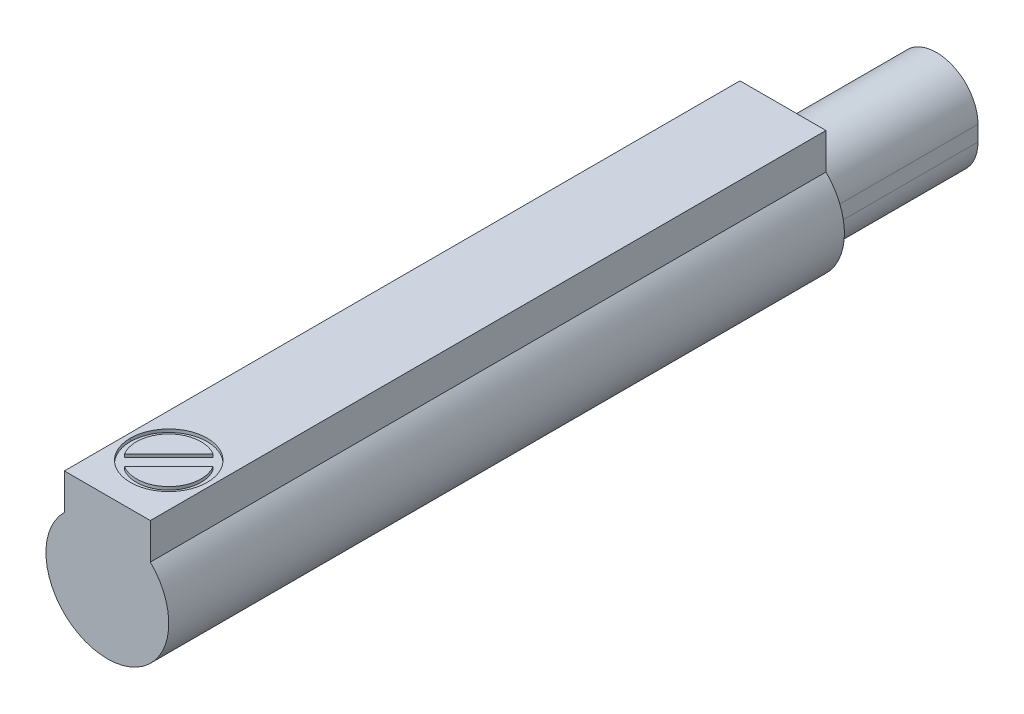
ISO-10303-21;
HEADER;
FILE_DESCRIPTION(('STEP AP214'),'2;1');
FILE_NAME('part.step','',(''),(''),'','','');
FILE_SCHEMA(('AUTOMOTIVE_DESIGN { 1 0 10303 214 1 1 1 1 }'));
ENDSEC;
DATA;
#1=APPLICATION_CONTEXT('core data for automotive mechanical design processes');
#2=APPLICATION_PROTOCOL_DEFINITION('international standard','automotive_design',2000,#1);
#3=PRODUCT_CONTEXT('',#1,'mechanical');
#4=PRODUCT('Part','Part','',(#3));
#5=PRODUCT_RELATED_PRODUCT_CATEGORY('part','',(#4));
#6=PRODUCT_DEFINITION_FORMATION('','',#4);
#7=PRODUCT_DEFINITION_CONTEXT('part definition',#1,'design');
#8=PRODUCT_DEFINITION('design','',#6,#7);
#9=PRODUCT_DEFINITION_SHAPE('','',#8);
#10=(LENGTH_UNIT() NAMED_UNIT(*) SI_UNIT(.MILLI.,.METRE.));
#11=(NAMED_UNIT(*) PLANE_ANGLE_UNIT() SI_UNIT($,.RADIAN.));
#12=(NAMED_UNIT(*) SI_UNIT($,.STERADIAN.) SOLID_ANGLE_UNIT());
#13=UNCERTAINTY_MEASURE_WITH_UNIT(LENGTH_MEASURE(1.E-05),#10,'distance_accuracy_value','');
#14=(GEOMETRIC_REPRESENTATION_CONTEXT(3) GLOBAL_UNCERTAINTY_ASSIGNED_CONTEXT((#13)) GLOBAL_UNIT_ASSIGNED_CONTEXT((#10,
#11,#12)) REPRESENTATION_CONTEXT('',''));
#15=CARTESIAN_POINT('',(0.,0.,0.));
#16=DIRECTION('',(0.,0.,1.));
#17=DIRECTION('',(1.,0.,0.));
#18=AXIS2_PLACEMENT_3D('',#15,#16,#17);
#19=CARTESIAN_POINT('',(1.4,2.6,-22.));
#20=DIRECTION('',(0.,1.,0.));
#21=DIRECTION('',(0.,0.,1.));
#22=AXIS2_PLACEMENT_3D('',#19,#20,#21);
#23=PLANE('',#22);
#24=CARTESIAN_POINT('',(0.,2.6,-2.));
#25=DIRECTION('',(0.,1.,0.));
#26=DIRECTION('',(1.,0.,0.));
#27=AXIS2_PLACEMENT_3D('',#24,#25,#26);
#28=CIRCLE('',#27,1.25);
#29=CARTESIAN_POINT('',(1.25,2.6,-2.));
#30=VERTEX_POINT('',#29);
#31=CARTESIAN_POINT('',(-1.25,2.6,-2.));
#32=VERTEX_POINT('',#31);
#33=EDGE_CURVE('E11',#30,#32,#28,.T.);
#34=ORIENTED_EDGE('',*,*,#33,.F.);
#35=CARTESIAN_POINT('',(0.,2.6,-2.));
#36=DIRECTION('',(0.,1.,0.));
#37=DIRECTION('',(1.,0.,0.));
#38=AXIS2_PLACEMENT_3D('',#35,#36,#37);
#39=CIRCLE('',#38,1.25);
#40=EDGE_CURVE('E25',#32,#30,#39,.T.);
#41=ORIENTED_EDGE('',*,*,#40,.F.);
#42=EDGE_LOOP('',(#34,#41));
#43=FACE_BOUND('',#42,.T.);
#44=DIRECTION('',(-1.,0.,0.));
#45=VECTOR('',#44,1.);
#46=CARTESIAN_POINT('',(1.4,2.6,0.));
#47=LINE('',#46,#45);
#48=CARTESIAN_POINT('',(1.4,2.6,0.));
#49=VERTEX_POINT('',#48);
#50=CARTESIAN_POINT('',(-1.4,2.6,0.));
#51=VERTEX_POINT('',#50);
#52=EDGE_CURVE('E291',#49,#51,#47,.T.);
#53=ORIENTED_EDGE('',*,*,#52,.F.);
#54=DIRECTION('',(0.,0.,1.));
#55=VECTOR('',#54,1.);
#56=CARTESIAN_POINT('',(1.4,2.6,-22.));
#57=LINE('',#56,#55);
#58=CARTESIAN_POINT('',(1.4,2.6,-22.));
#59=VERTEX_POINT('',#58);
#60=EDGE_CURVE('E286',#59,#49,#57,.T.);
#61=ORIENTED_EDGE('',*,*,#60,.F.);
#62=DIRECTION('',(-1.,0.,0.));
#63=VECTOR('',#62,1.);
#64=CARTESIAN_POINT('',(1.4,2.6,-22.));
#65=LINE('',#64,#63);
#66=CARTESIAN_POINT('',(-1.4,2.6,-22.));
#67=VERTEX_POINT('',#66);
#68=EDGE_CURVE('E282',#59,#67,#65,.T.);
#69=ORIENTED_EDGE('',*,*,#68,.T.);
#70=DIRECTION('',(0.,0.,1.));
#71=VECTOR('',#70,1.);
#72=CARTESIAN_POINT('',(-1.4,2.6,-22.));
#73=LINE('',#72,#71);
#74=EDGE_CURVE('E278',#67,#51,#73,.T.);
#75=ORIENTED_EDGE('',*,*,#74,.T.);
#76=EDGE_LOOP('',(#53,#61,#69,#75));
#77=FACE_BOUND('',#76,.T.);
#78=ADVANCED_FACE('F17',(#43,#77),#23,.T.);
#79=CARTESIAN_POINT('',(-1.4,2.6,-22.));
#80=DIRECTION('',(-1.,0.,0.));
#81=DIRECTION('',(0.,0.,1.));
#82=AXIS2_PLACEMENT_3D('',#79,#80,#81);
#83=PLANE('',#82);
#84=DIRECTION('',(0.,-1.,0.));
#85=VECTOR('',#84,1.);
#86=CARTESIAN_POINT('',(-1.4,2.6,0.));
#87=LINE('',#86,#85);
#88=CARTESIAN_POINT('',(-1.4,1.4282856857086,0.));
#89=VERTEX_POINT('',#88);
#90=EDGE_CURVE('E273',#51,#89,#87,.T.);
#91=ORIENTED_EDGE('',*,*,#90,.F.);
#92=ORIENTED_EDGE('',*,*,#74,.F.);
#93=DIRECTION('',(0.,-1.,0.));
#94=VECTOR('',#93,1.);
#95=CARTESIAN_POINT('',(-1.4,2.6,-22.));
#96=LINE('',#95,#94);
#97=CARTESIAN_POINT('',(-1.4,1.4282856857086,-22.));
#98=VERTEX_POINT('',#97);
#99=EDGE_CURVE('E269',#67,#98,#96,.T.);
#100=ORIENTED_EDGE('',*,*,#99,.T.);
#101=DIRECTION('',(0.,0.,1.));
#102=VECTOR('',#101,1.);
#103=CARTESIAN_POINT('',(-1.4,1.4282856857086,-22.));
#104=LINE('',#103,#102);
#105=EDGE_CURVE('E265',#98,#89,#104,.T.);
#106=ORIENTED_EDGE('',*,*,#105,.T.);
#107=EDGE_LOOP('',(#91,#92,#100,#106));
#108=FACE_BOUND('',#107,.T.);
#109=ADVANCED_FACE('F323',(#108),#83,.T.);
#110=CARTESIAN_POINT('',(0.,0.,-22.));
#111=DIRECTION('',(0.,0.,-1.));
#112=DIRECTION('',(0.,1.,0.));
#113=AXIS2_PLACEMENT_3D('',#110,#111,#112);
#114=CYLINDRICAL_SURFACE('',#113,2.);
#115=CARTESIAN_POINT('',(0.,0.,0.));
#116=DIRECTION('',(0.,0.,1.));
#117=DIRECTION('',(1.,0.,0.));
#118=AXIS2_PLACEMENT_3D('',#115,#116,#117);
#119=CIRCLE('',#118,2.);
#120=CARTESIAN_POINT('',(1.4,1.4282856857086,0.));
#121=VERTEX_POINT('',#120);
#122=EDGE_CURVE('E260',#89,#121,#119,.T.);
#123=ORIENTED_EDGE('',*,*,#122,.F.);
#124=ORIENTED_EDGE('',*,*,#105,.F.);
#125=CARTESIAN_POINT('',(0.,0.,-22.));
#126=DIRECTION('',(0.,0.,1.));
#127=DIRECTION('',(1.,0.,0.));
#128=AXIS2_PLACEMENT_3D('',#125,#126,#127);
#129=CIRCLE('',#128,2.);
#130=CARTESIAN_POINT('',(1.4,1.4282856857086,-22.));
#131=VERTEX_POINT('',#130);
#132=EDGE_CURVE('E256',#98,#131,#129,.T.);
#133=ORIENTED_EDGE('',*,*,#132,.T.);
#134=DIRECTION('',(0.,0.,1.));
#135=VECTOR('',#134,1.);
#136=CARTESIAN_POINT('',(1.4,1.4282856857086,-22.));
#137=LINE('',#136,#135);
#138=EDGE_CURVE('E252',#131,#121,#137,.T.);
#139=ORIENTED_EDGE('',*,*,#138,.T.);
#140=EDGE_LOOP('',(#123,#124,#133,#139));
#141=FACE_BOUND('',#140,.T.);
#142=ADVANCED_FACE('F327',(#141),#114,.T.);
#143=CARTESIAN_POINT('',(1.4,1.4282856857086,-22.));
#144=DIRECTION('',(1.,0.,0.));
#145=DIRECTION('',(0.,0.,-1.));
#146=AXIS2_PLACEMENT_3D('',#143,#144,#145);
#147=PLANE('',#146);
#148=DIRECTION('',(0.,1.,0.));
#149=VECTOR('',#148,1.);
#150=CARTESIAN_POINT('',(1.4,1.4282856857086,0.));
#151=LINE('',#150,#149);
#152=EDGE_CURVE('E247',#121,#49,#151,.T.);
#153=ORIENTED_EDGE('',*,*,#152,.F.);
#154=ORIENTED_EDGE('',*,*,#138,.F.);
#155=DIRECTION('',(0.,1.,0.));
#156=VECTOR('',#155,1.);
#157=CARTESIAN_POINT('',(1.4,1.4282856857086,-22.));
#158=LINE('',#157,#156);
#159=EDGE_CURVE('E242',#131,#59,#158,.T.);
#160=ORIENTED_EDGE('',*,*,#159,.T.);
#161=ORIENTED_EDGE('',*,*,#60,.T.);
#162=EDGE_LOOP('',(#153,#154,#160,#161));
#163=FACE_BOUND('',#162,.T.);
#164=ADVANCED_FACE('F335',(#163),#147,.T.);
#165=CARTESIAN_POINT('',(0.,0.,-22.));
#166=DIRECTION('',(0.,0.,1.));
#167=DIRECTION('',(1.,0.,0.));
#168=AXIS2_PLACEMENT_3D('',#165,#166,#167);
#169=PLANE('',#168);
#170=DIRECTION('',(0.,1.,0.));
#171=VECTOR('',#170,1.);
#172=CARTESIAN_POINT('',(1.35,-0.25,-22.));
#173=LINE('',#172,#171);
#174=CARTESIAN_POINT('',(1.35,-0.25,-22.));
#175=VERTEX_POINT('',#174);
#176=CARTESIAN_POINT('',(1.35,0.25,-22.));
#177=VERTEX_POINT('',#176);
#178=EDGE_CURVE('E238',#175,#177,#173,.T.);
#179=ORIENTED_EDGE('',*,*,#178,.T.);
#180=CARTESIAN_POINT('',(0.,0.249999999999934,-22.));
#181=DIRECTION('',(0.,0.,1.));
#182=DIRECTION('',(1.,0.,0.));
#183=AXIS2_PLACEMENT_3D('',#180,#181,#182);
#184=CIRCLE('',#183,1.35);
#185=CARTESIAN_POINT('',(-1.35,0.25,-22.));
#186=VERTEX_POINT('',#185);
#187=EDGE_CURVE('E234',#177,#186,#184,.T.);
#188=ORIENTED_EDGE('',*,*,#187,.T.);
#189=DIRECTION('',(0.,-1.,0.));
#190=VECTOR('',#189,1.);
#191=CARTESIAN_POINT('',(-1.35,0.25,-22.));
#192=LINE('',#191,#190);
#193=CARTESIAN_POINT('',(-1.35,-0.25,-22.));
#194=VERTEX_POINT('',#193);
#195=EDGE_CURVE('E230',#186,#194,#192,.T.);
#196=ORIENTED_EDGE('',*,*,#195,.T.);
#197=CARTESIAN_POINT('',(0.,-0.249999999999934,-22.));
#198=DIRECTION('',(0.,0.,1.));
#199=DIRECTION('',(1.,0.,0.));
#200=AXIS2_PLACEMENT_3D('',#197,#198,#199);
#201=CIRCLE('',#200,1.35);
#202=EDGE_CURVE('E226',#194,#175,#201,.T.);
#203=ORIENTED_EDGE('',*,*,#202,.T.);
#204=EDGE_LOOP('',(#179,#188,#196,#203));
#205=FACE_BOUND('',#204,.T.);
#206=ORIENTED_EDGE('',*,*,#99,.F.);
#207=ORIENTED_EDGE('',*,*,#68,.F.);
#208=ORIENTED_EDGE('',*,*,#159,.F.);
#209=ORIENTED_EDGE('',*,*,#132,.F.);
#210=EDGE_LOOP('',(#206,#207,#208,#209));
#211=FACE_BOUND('',#210,.T.);
#212=ADVANCED_FACE('F346',(#205,#211),#169,.F.);
#213=CARTESIAN_POINT('',(0.,-0.249999999999934,-27.));
#214=DIRECTION('',(0.,0.,-1.));
#215=DIRECTION('',(0.,1.,0.));
#216=AXIS2_PLACEMENT_3D('',#213,#214,#215);
#217=CYLINDRICAL_SURFACE('',#216,1.35);
#218=ORIENTED_EDGE('',*,*,#202,.F.);
#219=DIRECTION('',(0.,0.,1.));
#220=VECTOR('',#219,1.);
#221=CARTESIAN_POINT('',(-1.35,-0.25,-27.));
#222=LINE('',#221,#220);
#223=CARTESIAN_POINT('',(-1.35,-0.25,-27.));
#224=VERTEX_POINT('',#223);
#225=EDGE_CURVE('E221',#224,#194,#222,.T.);
#226=ORIENTED_EDGE('',*,*,#225,.F.);
#227=CARTESIAN_POINT('',(0.,-0.249999999999934,-27.));
#228=DIRECTION('',(0.,0.,1.));
#229=DIRECTION('',(1.,0.,0.));
#230=AXIS2_PLACEMENT_3D('',#227,#228,#229);
#231=CIRCLE('',#230,1.35);
#232=CARTESIAN_POINT('',(1.35,-0.25,-27.));
#233=VERTEX_POINT('',#232);
#234=EDGE_CURVE('E217',#224,#233,#231,.T.);
#235=ORIENTED_EDGE('',*,*,#234,.T.);
#236=DIRECTION('',(0.,0.,1.));
#237=VECTOR('',#236,1.);
#238=CARTESIAN_POINT('',(1.35,-0.25,-27.));
#239=LINE('',#238,#237);
#240=EDGE_CURVE('E212',#233,#175,#239,.T.);
#241=ORIENTED_EDGE('',*,*,#240,.T.);
#242=EDGE_LOOP('',(#218,#226,#235,#241));
#243=FACE_BOUND('',#242,.T.);
#244=ADVANCED_FACE('F348',(#243),#217,.T.);
#245=CARTESIAN_POINT('',(1.35,-0.25,-27.));
#246=DIRECTION('',(1.,0.,0.));
#247=DIRECTION('',(0.,0.,-1.));
#248=AXIS2_PLACEMENT_3D('',#245,#246,#247);
#249=PLANE('',#248);
#250=ORIENTED_EDGE('',*,*,#178,.F.);
#251=ORIENTED_EDGE('',*,*,#240,.F.);
#252=DIRECTION('',(0.,1.,0.));
#253=VECTOR('',#252,1.);
#254=CARTESIAN_POINT('',(1.35,-0.25,-27.));
#255=LINE('',#254,#253);
#256=CARTESIAN_POINT('',(1.35,0.25,-27.));
#257=VERTEX_POINT('',#256);
#258=EDGE_CURVE('E208',#233,#257,#255,.T.);
#259=ORIENTED_EDGE('',*,*,#258,.T.);
#260=DIRECTION('',(0.,0.,1.));
#261=VECTOR('',#260,1.);
#262=CARTESIAN_POINT('',(1.35,0.25,-27.));
#263=LINE('',#262,#261);
#264=EDGE_CURVE('E203',#257,#177,#263,.T.);
#265=ORIENTED_EDGE('',*,*,#264,.T.);
#266=EDGE_LOOP('',(#250,#251,#259,#265));
#267=FACE_BOUND('',#266,.T.);
#268=ADVANCED_FACE('F355',(#267),#249,.T.);
#269=CARTESIAN_POINT('',(0.,0.249999999999934,-27.));
#270=DIRECTION('',(0.,0.,-1.));
#271=DIRECTION('',(0.,-1.,0.));
#272=AXIS2_PLACEMENT_3D('',#269,#270,#271);
#273=CYLINDRICAL_SURFACE('',#272,1.35);
#274=ORIENTED_EDGE('',*,*,#187,.F.);
#275=ORIENTED_EDGE('',*,*,#264,.F.);
#276=CARTESIAN_POINT('',(0.,0.249999999999934,-27.));
#277=DIRECTION('',(0.,0.,1.));
#278=DIRECTION('',(1.,0.,0.));
#279=AXIS2_PLACEMENT_3D('',#276,#277,#278);
#280=CIRCLE('',#279,1.35);
#281=CARTESIAN_POINT('',(-1.35,0.25,-27.));
#282=VERTEX_POINT('',#281);
#283=EDGE_CURVE('E199',#257,#282,#280,.T.);
#284=ORIENTED_EDGE('',*,*,#283,.T.);
#285=DIRECTION('',(0.,0.,1.));
#286=VECTOR('',#285,1.);
#287=CARTESIAN_POINT('',(-1.35,0.25,-27.));
#288=LINE('',#287,#286);
#289=EDGE_CURVE('E194',#282,#186,#288,.T.);
#290=ORIENTED_EDGE('',*,*,#289,.T.);
#291=EDGE_LOOP('',(#274,#275,#284,#290));
#292=FACE_BOUND('',#291,.T.);
#293=ADVANCED_FACE('F389',(#292),#273,.T.);
#294=CARTESIAN_POINT('',(-1.35,0.25,-27.));
#295=DIRECTION('',(-1.,0.,0.));
#296=DIRECTION('',(0.,0.,1.));
#297=AXIS2_PLACEMENT_3D('',#294,#295,#296);
#298=PLANE('',#297);
#299=ORIENTED_EDGE('',*,*,#195,.F.);
#300=ORIENTED_EDGE('',*,*,#289,.F.);
#301=DIRECTION('',(0.,-1.,0.));
#302=VECTOR('',#301,1.);
#303=CARTESIAN_POINT('',(-1.35,0.25,-27.));
#304=LINE('',#303,#302);
#305=EDGE_CURVE('E189',#282,#224,#304,.T.);
#306=ORIENTED_EDGE('',*,*,#305,.T.);
#307=ORIENTED_EDGE('',*,*,#225,.T.);
#308=EDGE_LOOP('',(#299,#300,#306,#307));
#309=FACE_BOUND('',#308,.T.);
#310=ADVANCED_FACE('F397',(#309),#298,.T.);
#311=CARTESIAN_POINT('',(0.,0.249999999999934,-27.));
#312=DIRECTION('',(0.,0.,1.));
#313=DIRECTION('',(1.,0.,0.));
#314=AXIS2_PLACEMENT_3D('',#311,#312,#313);
#315=PLANE('',#314);
#316=ORIENTED_EDGE('',*,*,#283,.F.);
#317=ORIENTED_EDGE('',*,*,#258,.F.);
#318=ORIENTED_EDGE('',*,*,#234,.F.);
#319=ORIENTED_EDGE('',*,*,#305,.F.);
#320=EDGE_LOOP('',(#316,#317,#318,#319));
#321=FACE_BOUND('',#320,.T.);
#322=ADVANCED_FACE('F406',(#321),#315,.F.);
#323=CARTESIAN_POINT('',(0.,0.,0.));
#324=DIRECTION('',(0.,0.,1.));
#325=DIRECTION('',(1.,0.,0.));
#326=AXIS2_PLACEMENT_3D('',#323,#324,#325);
#327=PLANE('',#326);
#328=ORIENTED_EDGE('',*,*,#90,.T.);
#329=ORIENTED_EDGE('',*,*,#122,.T.);
#330=ORIENTED_EDGE('',*,*,#152,.T.);
#331=ORIENTED_EDGE('',*,*,#52,.T.);
#332=EDGE_LOOP('',(#328,#329,#330,#331));
#333=FACE_BOUND('',#332,.T.);
#334=ADVANCED_FACE('F339',(#333),#327,.T.);
#335=CARTESIAN_POINT('',(0.,2.5,-2.));
#336=DIRECTION('',(0.,-1.,0.));
#337=DIRECTION('',(0.,0.,-1.));
#338=AXIS2_PLACEMENT_3D('',#335,#336,#337);
#339=CYLINDRICAL_SURFACE('',#338,1.25);
#340=CARTESIAN_POINT('',(0.,2.5,-2.));
#341=DIRECTION('',(0.,1.,0.));
#342=DIRECTION('',(1.,0.,0.));
#343=AXIS2_PLACEMENT_3D('',#340,#341,#342);
#344=CIRCLE('',#343,1.25);
#345=CARTESIAN_POINT('',(-1.25,2.5,-2.));
#346=VERTEX_POINT('',#345);
#347=CARTESIAN_POINT('',(1.25,2.5,-2.));
#348=VERTEX_POINT('',#347);
#349=EDGE_CURVE('E184',#346,#348,#344,.T.);
#350=ORIENTED_EDGE('',*,*,#349,.F.);
#351=DIRECTION('',(0.,-1.,0.));
#352=VECTOR('',#351,1.);
#353=CARTESIAN_POINT('',(-1.25,2.6,-2.));
#354=LINE('',#353,#352);
#355=EDGE_CURVE('E179',#32,#346,#354,.T.);
#356=ORIENTED_EDGE('',*,*,#355,.F.);
#357=ORIENTED_EDGE('',*,*,#40,.T.);
#358=DIRECTION('',(0.,-1.,0.));
#359=VECTOR('',#358,1.);
#360=CARTESIAN_POINT('',(1.25,2.6,-2.));
#361=LINE('',#360,#359);
#362=EDGE_CURVE('E175',#30,#348,#361,.T.);
#363=ORIENTED_EDGE('',*,*,#362,.T.);
#364=EDGE_LOOP('',(#350,#356,#357,#363));
#365=FACE_BOUND('',#364,.T.);
#366=ADVANCED_FACE('F302',(#365),#339,.F.);
#367=CARTESIAN_POINT('',(0.,2.5,-2.));
#368=DIRECTION('',(0.,-1.,0.));
#369=DIRECTION('',(0.,0.,1.));
#370=AXIS2_PLACEMENT_3D('',#367,#368,#369);
#371=CYLINDRICAL_SURFACE('',#370,1.25);
#372=ORIENTED_EDGE('',*,*,#33,.T.);
#373=ORIENTED_EDGE('',*,*,#355,.T.);
#374=CARTESIAN_POINT('',(0.,2.5,-2.));
#375=DIRECTION('',(0.,1.,0.));
#376=DIRECTION('',(1.,0.,0.));
#377=AXIS2_PLACEMENT_3D('',#374,#375,#376);
#378=CIRCLE('',#377,1.25);
#379=EDGE_CURVE('E170',#348,#346,#378,.T.);
#380=ORIENTED_EDGE('',*,*,#379,.F.);
#381=ORIENTED_EDGE('',*,*,#362,.F.);
#382=EDGE_LOOP('',(#372,#373,#380,#381));
#383=FACE_BOUND('',#382,.T.);
#384=ADVANCED_FACE('F305',(#383),#371,.F.);
#385=CARTESIAN_POINT('',(0.,2.5,-2.));
#386=DIRECTION('',(0.,1.,0.));
#387=DIRECTION('',(0.,0.,1.));
#388=AXIS2_PLACEMENT_3D('',#385,#386,#387);
#389=PLANE('',#388);
#390=CARTESIAN_POINT('',(0.,2.5,-2.));
#391=DIRECTION('',(0.,1.,0.));
#392=DIRECTION('',(1.,0.,0.));
#393=AXIS2_PLACEMENT_3D('',#390,#391,#392);
#394=CIRCLE('',#393,1.05);
#395=CARTESIAN_POINT('',(-0.54433355979616,2.5,-1.1021130496106));
#396=VERTEX_POINT('',#395);
#397=CARTESIAN_POINT('',(0.89788695038943,2.5,-2.5443335597962));
#398=VERTEX_POINT('',#397);
#399=EDGE_CURVE('E166',#396,#398,#394,.T.);
#400=ORIENTED_EDGE('',*,*,#399,.F.);
#401=DIRECTION('',(0.707106781186545,0.,-0.70710678118655));
#402=VECTOR('',#401,1.);
#403=CARTESIAN_POINT('',(-0.54433355979616,2.5,-1.1021130496106));
#404=LINE('',#403,#402);
#405=EDGE_CURVE('E120',#396,#398,#404,.T.);
#406=ORIENTED_EDGE('',*,*,#405,.T.);
#407=EDGE_LOOP('',(#400,#406));
#408=FACE_BOUND('',#407,.T.);
#409=CARTESIAN_POINT('',(0.,2.5,-2.));
#410=DIRECTION('',(0.,1.,0.));
#411=DIRECTION('',(1.,0.,0.));
#412=AXIS2_PLACEMENT_3D('',#409,#410,#411);
#413=CIRCLE('',#412,1.05);
#414=CARTESIAN_POINT('',(0.54433355979616,2.5,-2.8978869503894));
#415=VERTEX_POINT('',#414);
#416=CARTESIAN_POINT('',(-0.89788695038943,2.5,-1.4556664402038));
#417=VERTEX_POINT('',#416);
#418=EDGE_CURVE('E158',#415,#417,#413,.T.);
#419=ORIENTED_EDGE('',*,*,#418,.F.);
#420=DIRECTION('',(-0.707106781186545,0.,0.70710678118655));
#421=VECTOR('',#420,1.);
#422=CARTESIAN_POINT('',(0.54433355979616,2.5,-2.8978869503894));
#423=LINE('',#422,#421);
#424=EDGE_CURVE('E154',#415,#417,#423,.T.);
#425=ORIENTED_EDGE('',*,*,#424,.T.);
#426=EDGE_LOOP('',(#419,#425));
#427=FACE_BOUND('',#426,.T.);
#428=ORIENTED_EDGE('',*,*,#379,.T.);
#429=ORIENTED_EDGE('',*,*,#349,.T.);
#430=EDGE_LOOP('',(#428,#429));
#431=FACE_BOUND('',#430,.T.);
#432=ADVANCED_FACE('F307',(#408,#427,#431),#389,.T.);
#433=CARTESIAN_POINT('',(0.54433355979616,2.5,-2.8978869503894));
#434=DIRECTION('',(-0.70710678118655,0.,-0.707106781186545));
#435=DIRECTION('',(-0.707106781186545,0.,0.70710678118655));
#436=AXIS2_PLACEMENT_3D('',#433,#434,#435);
#437=PLANE('',#436);
#438=DIRECTION('',(-0.707106781186545,0.,0.70710678118655));
#439=VECTOR('',#438,1.);
#440=CARTESIAN_POINT('',(0.54433355979616,2.6,-2.8978869503894));
#441=LINE('',#440,#439);
#442=CARTESIAN_POINT('',(0.54433355979616,2.6,-2.8978869503894));
#443=VERTEX_POINT('',#442);
#444=CARTESIAN_POINT('',(-0.89788695038943,2.6,-1.4556664402038));
#445=VERTEX_POINT('',#444);
#446=EDGE_CURVE('E150',#443,#445,#441,.T.);
#447=ORIENTED_EDGE('',*,*,#446,.T.);
#448=DIRECTION('',(0.,1.,0.));
#449=VECTOR('',#448,1.);
#450=CARTESIAN_POINT('',(-0.89788695038943,2.5,-1.4556664402038));
#451=LINE('',#450,#449);
#452=EDGE_CURVE('E145',#417,#445,#451,.T.);
#453=ORIENTED_EDGE('',*,*,#452,.F.);
#454=ORIENTED_EDGE('',*,*,#424,.F.);
#455=DIRECTION('',(0.,1.,0.));
#456=VECTOR('',#455,1.);
#457=CARTESIAN_POINT('',(0.54433355979616,2.5,-2.8978869503894));
#458=LINE('',#457,#456);
#459=EDGE_CURVE('E134',#415,#443,#458,.T.);
#460=ORIENTED_EDGE('',*,*,#459,.T.);
#461=EDGE_LOOP('',(#447,#453,#454,#460));
#462=FACE_BOUND('',#461,.T.);
#463=ADVANCED_FACE('F309',(#462),#437,.F.);
#464=CARTESIAN_POINT('',(0.,2.5,-2.));
#465=DIRECTION('',(0.,-1.,0.));
#466=DIRECTION('',(0.707106781186554,0.,0.707106781186541));
#467=AXIS2_PLACEMENT_3D('',#464,#465,#466);
#468=CYLINDRICAL_SURFACE('',#467,1.05);
#469=ORIENTED_EDGE('',*,*,#452,.T.);
#470=CARTESIAN_POINT('',(0.,2.6,-2.));
#471=DIRECTION('',(0.,1.,0.));
#472=DIRECTION('',(1.,0.,0.));
#473=AXIS2_PLACEMENT_3D('',#470,#471,#472);
#474=CIRCLE('',#473,1.05);
#475=EDGE_CURVE('E131',#443,#445,#474,.T.);
#476=ORIENTED_EDGE('',*,*,#475,.F.);
#477=ORIENTED_EDGE('',*,*,#459,.F.);
#478=ORIENTED_EDGE('',*,*,#418,.T.);
#479=EDGE_LOOP('',(#469,#476,#477,#478));
#480=FACE_BOUND('',#479,.T.);
#481=ADVANCED_FACE('F317',(#480),#468,.T.);
#482=CARTESIAN_POINT('',(1.4,2.6,-22.));
#483=DIRECTION('',(0.,1.,0.));
#484=DIRECTION('',(0.,0.,1.));
#485=AXIS2_PLACEMENT_3D('',#482,#483,#484);
#486=PLANE('',#485);
#487=ORIENTED_EDGE('',*,*,#446,.F.);
#488=ORIENTED_EDGE('',*,*,#475,.T.);
#489=EDGE_LOOP('',(#487,#488));
#490=FACE_BOUND('',#489,.T.);
#491=ADVANCED_FACE('F450',(#490),#486,.T.);
#492=CARTESIAN_POINT('',(-0.54433355979616,2.5,-1.1021130496106));
#493=DIRECTION('',(0.70710678118655,0.,0.707106781186545));
#494=DIRECTION('',(0.707106781186545,0.,-0.70710678118655));
#495=AXIS2_PLACEMENT_3D('',#492,#493,#494);
#496=PLANE('',#495);
#497=DIRECTION('',(0.707106781186545,0.,-0.70710678118655));
#498=VECTOR('',#497,1.);
#499=CARTESIAN_POINT('',(-0.54433355979616,2.6,-1.1021130496106));
#500=LINE('',#499,#498);
#501=CARTESIAN_POINT('',(-0.544333559796181,2.6,-1.10211304961058));
#502=VERTEX_POINT('',#501);
#503=CARTESIAN_POINT('',(0.89788695038943,2.6,-2.5443335597962));
#504=VERTEX_POINT('',#503);
#505=EDGE_CURVE('E118',#502,#504,#500,.T.);
#506=ORIENTED_EDGE('',*,*,#505,.T.);
#507=DIRECTION('',(0.,1.,0.));
#508=VECTOR('',#507,1.);
#509=CARTESIAN_POINT('',(0.89788695038943,2.5,-2.5443335597962));
#510=LINE('',#509,#508);
#511=EDGE_CURVE('E123',#398,#504,#510,.T.);
#512=ORIENTED_EDGE('',*,*,#511,.F.);
#513=ORIENTED_EDGE('',*,*,#405,.F.);
#514=DIRECTION('',(0.,1.,0.));
#515=VECTOR('',#514,1.);
#516=CARTESIAN_POINT('',(-0.54433355979616,2.5,-1.1021130496106));
#517=LINE('',#516,#515);
#518=EDGE_CURVE('E113',#396,#502,#517,.T.);
#519=ORIENTED_EDGE('',*,*,#518,.T.);
#520=EDGE_LOOP('',(#506,#512,#513,#519));
#521=FACE_BOUND('',#520,.T.);
#522=ADVANCED_FACE('F115',(#521),#496,.F.);
#523=CARTESIAN_POINT('',(0.,2.5,-2.));
#524=DIRECTION('',(0.,-1.,0.));
#525=DIRECTION('',(-0.707106781186551,0.,-0.707106781186544));
#526=AXIS2_PLACEMENT_3D('',#523,#524,#525);
#527=CYLINDRICAL_SURFACE('',#526,1.05);
#528=ORIENTED_EDGE('',*,*,#511,.T.);
#529=CARTESIAN_POINT('',(0.,2.6,-2.));
#530=DIRECTION('',(0.,1.,0.));
#531=DIRECTION('',(1.,0.,0.));
#532=AXIS2_PLACEMENT_3D('',#529,#530,#531);
#533=CIRCLE('',#532,1.05);
#534=EDGE_CURVE('E124',#502,#504,#533,.T.);
#535=ORIENTED_EDGE('',*,*,#534,.F.);
#536=ORIENTED_EDGE('',*,*,#518,.F.);
#537=ORIENTED_EDGE('',*,*,#399,.T.);
#538=EDGE_LOOP('',(#528,#535,#536,#537));
#539=FACE_BOUND('',#538,.T.);
#540=ADVANCED_FACE('F127',(#539),#527,.T.);
#541=CARTESIAN_POINT('',(1.4,2.6,-22.));
#542=DIRECTION('',(0.,1.,0.));
#543=DIRECTION('',(0.,0.,1.));
#544=AXIS2_PLACEMENT_3D('',#541,#542,#543);
#545=PLANE('',#544);
#546=ORIENTED_EDGE('',*,*,#505,.F.);
#547=ORIENTED_EDGE('',*,*,#534,.T.);
#548=EDGE_LOOP('',(#546,#547));
#549=FACE_BOUND('',#548,.T.);
#550=ADVANCED_FACE('F130',(#549),#545,.T.);
#551=CLOSED_SHELL('',(#78,#109,#142,#164,#212,#244,#268,#293,#310,#322,#334,#366,#384,#432,#463,
#481,#491,#522,#540,#550));
#552=MANIFOLD_SOLID_BREP('B1',#551);
#553=ADVANCED_BREP_SHAPE_REPRESENTATION('',(#18,#552),#14);
#554=SHAPE_DEFINITION_REPRESENTATION(#9,#553);
ENDSEC;
END-ISO-10303-21;
